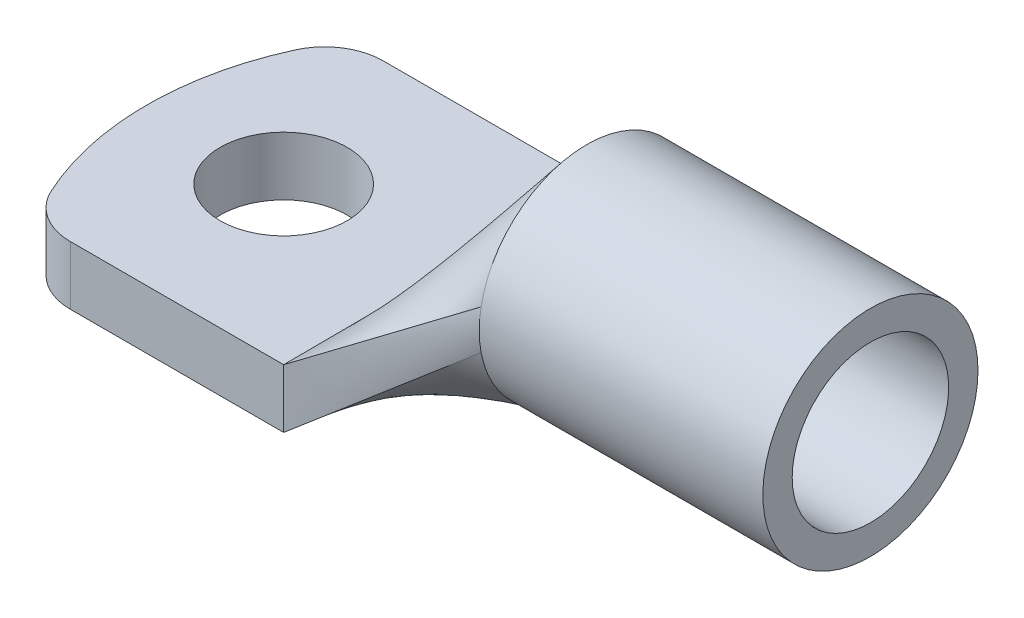
ISO-10303-21;
HEADER;
FILE_DESCRIPTION(('STEP AP214'),'2;1');
FILE_NAME('part.step','',(''),(''),'','','');
FILE_SCHEMA(('AUTOMOTIVE_DESIGN { 1 0 10303 214 1 1 1 1 }'));
ENDSEC;
DATA;
#1=APPLICATION_CONTEXT('core data for automotive mechanical design processes');
#2=APPLICATION_PROTOCOL_DEFINITION('international standard','automotive_design',2000,#1);
#3=PRODUCT_CONTEXT('',#1,'mechanical');
#4=PRODUCT('Part','Part','',(#3));
#5=PRODUCT_RELATED_PRODUCT_CATEGORY('part','',(#4));
#6=PRODUCT_DEFINITION_FORMATION('','',#4);
#7=PRODUCT_DEFINITION_CONTEXT('part definition',#1,'design');
#8=PRODUCT_DEFINITION('design','',#6,#7);
#9=PRODUCT_DEFINITION_SHAPE('','',#8);
#10=(LENGTH_UNIT() NAMED_UNIT(*) SI_UNIT(.MILLI.,.METRE.));
#11=(NAMED_UNIT(*) PLANE_ANGLE_UNIT() SI_UNIT($,.RADIAN.));
#12=(NAMED_UNIT(*) SI_UNIT($,.STERADIAN.) SOLID_ANGLE_UNIT());
#13=UNCERTAINTY_MEASURE_WITH_UNIT(LENGTH_MEASURE(1.E-05),#10,'distance_accuracy_value','');
#14=(GEOMETRIC_REPRESENTATION_CONTEXT(3) GLOBAL_UNCERTAINTY_ASSIGNED_CONTEXT((#13)) GLOBAL_UNIT_ASSIGNED_CONTEXT((#10,
#11,#12)) REPRESENTATION_CONTEXT('',''));
#15=CARTESIAN_POINT('',(0.,0.,0.));
#16=DIRECTION('',(0.,0.,1.));
#17=DIRECTION('',(1.,0.,0.));
#18=AXIS2_PLACEMENT_3D('',#15,#16,#17);
#19=CARTESIAN_POINT('',(0.,3.,-8.));
#20=DIRECTION('',(0.,0.,-1.));
#21=DIRECTION('',(-1.,0.,0.));
#22=AXIS2_PLACEMENT_3D('',#19,#20,#21);
#23=PLANE('',#22);
#24=DIRECTION('',(1.,0.,0.));
#25=VECTOR('',#24,1.);
#26=CARTESIAN_POINT('',(0.,0.,-8.));
#27=LINE('',#26,#25);
#28=CARTESIAN_POINT('',(-3.40871211463572,0.,-8.));
#29=VERTEX_POINT('',#28);
#30=CARTESIAN_POINT('',(7.5,0.,-8.));
#31=VERTEX_POINT('',#30);
#32=EDGE_CURVE('E170',#29,#31,#27,.T.);
#33=ORIENTED_EDGE('',*,*,#32,.F.);
#34=DIRECTION('',(0.,1.,0.));
#35=VECTOR('',#34,1.);
#36=CARTESIAN_POINT('',(-3.40871211463572,3.,-8.));
#37=LINE('',#36,#35);
#38=CARTESIAN_POINT('',(-3.40871211463572,3.,-8.));
#39=VERTEX_POINT('',#38);
#40=EDGE_CURVE('E332',#29,#39,#37,.T.);
#41=ORIENTED_EDGE('',*,*,#40,.T.);
#42=DIRECTION('',(1.,0.,0.));
#43=VECTOR('',#42,1.);
#44=CARTESIAN_POINT('',(0.,3.,-8.));
#45=LINE('',#44,#43);
#46=CARTESIAN_POINT('',(7.5,3.,-8.));
#47=VERTEX_POINT('',#46);
#48=EDGE_CURVE('E177',#39,#47,#45,.T.);
#49=ORIENTED_EDGE('',*,*,#48,.T.);
#50=DIRECTION('',(0.,1.,0.));
#51=VECTOR('',#50,1.);
#52=CARTESIAN_POINT('',(7.5,3.,-8.));
#53=LINE('',#52,#51);
#54=EDGE_CURVE('E183',#47,#31,#53,.F.);
#55=ORIENTED_EDGE('',*,*,#54,.T.);
#56=EDGE_LOOP('',(#33,#41,#49,#55));
#57=FACE_BOUND('',#56,.T.);
#58=ADVANCED_FACE('F72',(#57),#23,.T.);
#59=CARTESIAN_POINT('',(7.5,3.,0.));
#60=DIRECTION('',(0.,-1.,0.));
#61=DIRECTION('',(0.,0.,-1.));
#62=AXIS2_PLACEMENT_3D('',#59,#60,#61);
#63=CYLINDRICAL_SURFACE('',#62,15.);
#64=CARTESIAN_POINT('',(7.5,3.,0.));
#65=DIRECTION('',(0.,1.,0.));
#66=DIRECTION('',(0.,0.,1.));
#67=AXIS2_PLACEMENT_3D('',#64,#65,#66);
#68=CIRCLE('',#67,15.);
#69=CARTESIAN_POINT('',(-6.13589014329465,3.,-6.25));
#70=VERTEX_POINT('',#69);
#71=CARTESIAN_POINT('',(-6.13589014329465,3.,6.25));
#72=VERTEX_POINT('',#71);
#73=EDGE_CURVE('E176',#70,#72,#68,.T.);
#74=ORIENTED_EDGE('',*,*,#73,.F.);
#75=DIRECTION('',(0.,-1.,0.));
#76=VECTOR('',#75,1.);
#77=CARTESIAN_POINT('',(-6.13589014329465,3.,-6.25));
#78=LINE('',#77,#76);
#79=CARTESIAN_POINT('',(-6.13589014329465,0.,-6.25));
#80=VERTEX_POINT('',#79);
#81=EDGE_CURVE('E155',#70,#80,#78,.T.);
#82=ORIENTED_EDGE('',*,*,#81,.T.);
#83=CARTESIAN_POINT('',(7.5,0.,0.));
#84=DIRECTION('',(0.,1.,0.));
#85=DIRECTION('',(0.,0.,1.));
#86=AXIS2_PLACEMENT_3D('',#83,#84,#85);
#87=CIRCLE('',#86,15.);
#88=CARTESIAN_POINT('',(-6.13589014329465,0.,6.25));
#89=VERTEX_POINT('',#88);
#90=EDGE_CURVE('E166',#80,#89,#87,.T.);
#91=ORIENTED_EDGE('',*,*,#90,.T.);
#92=DIRECTION('',(0.,-1.,0.));
#93=VECTOR('',#92,1.);
#94=CARTESIAN_POINT('',(-6.13589014329465,3.,6.25));
#95=LINE('',#94,#93);
#96=EDGE_CURVE('E151',#89,#72,#95,.F.);
#97=ORIENTED_EDGE('',*,*,#96,.T.);
#98=EDGE_LOOP('',(#74,#82,#91,#97));
#99=FACE_BOUND('',#98,.T.);
#100=ADVANCED_FACE('F341',(#99),#63,.T.);
#101=CARTESIAN_POINT('',(0.,3.,8.));
#102=DIRECTION('',(0.,0.,-1.));
#103=DIRECTION('',(-1.,0.,0.));
#104=AXIS2_PLACEMENT_3D('',#101,#102,#103);
#105=PLANE('',#104);
#106=DIRECTION('',(1.,0.,0.));
#107=VECTOR('',#106,1.);
#108=CARTESIAN_POINT('',(0.,3.,8.));
#109=LINE('',#108,#107);
#110=CARTESIAN_POINT('',(-3.40871211463572,3.,8.));
#111=VERTEX_POINT('',#110);
#112=CARTESIAN_POINT('',(7.49999999999999,3.,8.));
#113=VERTEX_POINT('',#112);
#114=EDGE_CURVE('E162',#111,#113,#109,.T.);
#115=ORIENTED_EDGE('',*,*,#114,.F.);
#116=DIRECTION('',(0.,-1.,0.));
#117=VECTOR('',#116,1.);
#118=CARTESIAN_POINT('',(-3.40871211463572,3.,8.));
#119=LINE('',#118,#117);
#120=CARTESIAN_POINT('',(-3.40871211463572,0.,8.));
#121=VERTEX_POINT('',#120);
#122=EDGE_CURVE('E83',#111,#121,#119,.T.);
#123=ORIENTED_EDGE('',*,*,#122,.T.);
#124=DIRECTION('',(1.,0.,0.));
#125=VECTOR('',#124,1.);
#126=CARTESIAN_POINT('',(0.,0.,8.));
#127=LINE('',#126,#125);
#128=CARTESIAN_POINT('',(7.5,0.,8.));
#129=VERTEX_POINT('',#128);
#130=EDGE_CURVE('E160',#121,#129,#127,.T.);
#131=ORIENTED_EDGE('',*,*,#130,.T.);
#132=DIRECTION('',(0.,1.,0.));
#133=VECTOR('',#132,1.);
#134=CARTESIAN_POINT('',(7.5,3.,8.));
#135=LINE('',#134,#133);
#136=EDGE_CURVE('E181',#113,#129,#135,.F.);
#137=ORIENTED_EDGE('',*,*,#136,.F.);
#138=EDGE_LOOP('',(#115,#123,#131,#137));
#139=FACE_BOUND('',#138,.T.);
#140=ADVANCED_FACE('F158',(#139),#105,.F.);
#141=CARTESIAN_POINT('',(-0.500000000000001,3.,0.));
#142=DIRECTION('',(0.,-1.,0.));
#143=DIRECTION('',(0.,0.,-1.));
#144=AXIS2_PLACEMENT_3D('',#141,#142,#143);
#145=CYLINDRICAL_SURFACE('',#144,3.25);
#146=CARTESIAN_POINT('',(-0.500000000000001,3.,0.));
#147=DIRECTION('',(0.,1.,0.));
#148=DIRECTION('',(0.,0.,1.));
#149=AXIS2_PLACEMENT_3D('',#146,#147,#148);
#150=CIRCLE('',#149,3.25);
#151=CARTESIAN_POINT('',(-0.500000000000001,3.,3.25));
#152=VERTEX_POINT('',#151);
#153=EDGE_CURVE('E168',#152,#152,#150,.T.);
#154=ORIENTED_EDGE('',*,*,#153,.T.);
#155=EDGE_LOOP('',(#154));
#156=FACE_BOUND('',#155,.T.);
#157=CARTESIAN_POINT('',(-0.500000000000001,0.,0.));
#158=DIRECTION('',(0.,1.,0.));
#159=DIRECTION('',(0.,0.,1.));
#160=AXIS2_PLACEMENT_3D('',#157,#158,#159);
#161=CIRCLE('',#160,3.25);
#162=CARTESIAN_POINT('',(-0.500000000000001,0.,3.25));
#163=VERTEX_POINT('',#162);
#164=EDGE_CURVE('E180',#163,#163,#161,.T.);
#165=ORIENTED_EDGE('',*,*,#164,.F.);
#166=EDGE_LOOP('',(#165));
#167=FACE_BOUND('',#166,.T.);
#168=ADVANCED_FACE('F360',(#156,#167),#145,.F.);
#169=CARTESIAN_POINT('',(0.,3.,0.));
#170=DIRECTION('',(0.,1.,0.));
#171=DIRECTION('',(0.,0.,1.));
#172=AXIS2_PLACEMENT_3D('',#169,#170,#171);
#173=PLANE('',#172);
#174=ORIENTED_EDGE('',*,*,#153,.F.);
#175=EDGE_LOOP('',(#174));
#176=FACE_BOUND('',#175,.T.);
#177=ORIENTED_EDGE('',*,*,#48,.F.);
#178=CARTESIAN_POINT('',(-3.40871211463572,3.,-5.));
#179=DIRECTION('',(0.,1.,0.));
#180=DIRECTION('',(0.,0.,1.));
#181=AXIS2_PLACEMENT_3D('',#178,#179,#180);
#182=CIRCLE('',#181,3.);
#183=EDGE_CURVE('E163',#39,#70,#182,.T.);
#184=ORIENTED_EDGE('',*,*,#183,.T.);
#185=ORIENTED_EDGE('',*,*,#73,.T.);
#186=CARTESIAN_POINT('',(-3.40871211463572,3.,5.));
#187=DIRECTION('',(0.,1.,0.));
#188=DIRECTION('',(0.,0.,1.));
#189=AXIS2_PLACEMENT_3D('',#186,#187,#188);
#190=CIRCLE('',#189,3.);
#191=EDGE_CURVE('E92',#72,#111,#190,.T.);
#192=ORIENTED_EDGE('',*,*,#191,.T.);
#193=ORIENTED_EDGE('',*,*,#114,.T.);
#194=DIRECTION('',(0.,0.,1.));
#195=VECTOR('',#194,1.);
#196=CARTESIAN_POINT('',(7.5,3.,0.));
#197=LINE('',#196,#195);
#198=EDGE_CURVE('E175',#113,#47,#197,.F.);
#199=ORIENTED_EDGE('',*,*,#198,.T.);
#200=EDGE_LOOP('',(#177,#184,#185,#192,#193,#199));
#201=FACE_BOUND('',#200,.T.);
#202=ADVANCED_FACE('F327',(#176,#201),#173,.T.);
#203=CARTESIAN_POINT('',(0.,0.,0.));
#204=DIRECTION('',(0.,1.,0.));
#205=DIRECTION('',(0.,0.,1.));
#206=AXIS2_PLACEMENT_3D('',#203,#204,#205);
#207=PLANE('',#206);
#208=ORIENTED_EDGE('',*,*,#164,.T.);
#209=EDGE_LOOP('',(#208));
#210=FACE_BOUND('',#209,.T.);
#211=ORIENTED_EDGE('',*,*,#90,.F.);
#212=CARTESIAN_POINT('',(-3.40871211463572,0.,-5.));
#213=DIRECTION('',(0.,1.,0.));
#214=DIRECTION('',(0.,0.,1.));
#215=AXIS2_PLACEMENT_3D('',#212,#213,#214);
#216=CIRCLE('',#215,3.);
#217=EDGE_CURVE('E154',#80,#29,#216,.F.);
#218=ORIENTED_EDGE('',*,*,#217,.T.);
#219=ORIENTED_EDGE('',*,*,#32,.T.);
#220=DIRECTION('',(0.,0.,1.));
#221=VECTOR('',#220,1.);
#222=CARTESIAN_POINT('',(7.5,0.,0.));
#223=LINE('',#222,#221);
#224=EDGE_CURVE('E112',#129,#31,#223,.F.);
#225=ORIENTED_EDGE('',*,*,#224,.F.);
#226=ORIENTED_EDGE('',*,*,#130,.F.);
#227=CARTESIAN_POINT('',(-3.40871211463572,0.,5.));
#228=DIRECTION('',(0.,1.,0.));
#229=DIRECTION('',(0.,0.,1.));
#230=AXIS2_PLACEMENT_3D('',#227,#228,#229);
#231=CIRCLE('',#230,3.);
#232=EDGE_CURVE('E149',#121,#89,#231,.F.);
#233=ORIENTED_EDGE('',*,*,#232,.T.);
#234=EDGE_LOOP('',(#211,#218,#219,#225,#226,#233));
#235=FACE_BOUND('',#234,.T.);
#236=ADVANCED_FACE('F165',(#210,#235),#207,.F.);
#237=CARTESIAN_POINT('',(-3.40871211463572,3.,-5.));
#238=DIRECTION('',(0.,-1.,0.));
#239=DIRECTION('',(0.,0.,-1.));
#240=AXIS2_PLACEMENT_3D('',#237,#238,#239);
#241=CYLINDRICAL_SURFACE('',#240,3.);
#242=ORIENTED_EDGE('',*,*,#183,.F.);
#243=ORIENTED_EDGE('',*,*,#40,.F.);
#244=ORIENTED_EDGE('',*,*,#217,.F.);
#245=ORIENTED_EDGE('',*,*,#81,.F.);
#246=EDGE_LOOP('',(#242,#243,#244,#245));
#247=FACE_BOUND('',#246,.T.);
#248=ADVANCED_FACE('F342',(#247),#241,.T.);
#249=CARTESIAN_POINT('',(-3.40871211463572,3.,5.));
#250=DIRECTION('',(0.,-1.,0.));
#251=DIRECTION('',(0.,0.,-1.));
#252=AXIS2_PLACEMENT_3D('',#249,#250,#251);
#253=CYLINDRICAL_SURFACE('',#252,3.);
#254=ORIENTED_EDGE('',*,*,#191,.F.);
#255=ORIENTED_EDGE('',*,*,#96,.F.);
#256=ORIENTED_EDGE('',*,*,#232,.F.);
#257=ORIENTED_EDGE('',*,*,#122,.F.);
#258=EDGE_LOOP('',(#254,#255,#256,#257));
#259=FACE_BOUND('',#258,.T.);
#260=ADVANCED_FACE('F74',(#259),#253,.T.);
#261=CARTESIAN_POINT('',(7.5,0.,-8.));
#262=CARTESIAN_POINT('',(15.,5.98641305722398,-5.40579702813877));
#263=CARTESIAN_POINT('',(7.5,0.499999999999998,-8.));
#264=CARTESIAN_POINT('',(15.,6.31848852892209,-5.46806117908217));
#265=CARTESIAN_POINT('',(7.5,0.999999999999997,-8.));
#266=CARTESIAN_POINT('',(15.,6.65924426446105,-5.49919325455386));
#267=CARTESIAN_POINT('',(7.5,2.,-8.));
#268=CARTESIAN_POINT('',(15.,7.34075573553895,-5.49919325455386));
#269=CARTESIAN_POINT('',(7.5,2.5,-8.));
#270=CARTESIAN_POINT('',(15.,7.68151147107791,-5.46806117908217));
#271=CARTESIAN_POINT('',(7.5,3.,-8.));
#272=CARTESIAN_POINT('',(15.,8.01358694277602,-5.40579702813877));
#273=B_SPLINE_SURFACE_WITH_KNOTS('',3,1,((#261,#262),(#263,#264),(#265,#266),(#267,#268),(#269,
#270),(#271,#272)),.UNSPECIFIED.,.F.,.F.,.F.,(4,2,4),(2,2),(0.,0.5,1.),(0.,1.),.UNSPECIFIED.);
#274=DIRECTION('',(0.798976519768319,0.534098432946009,0.276360968270708));
#275=VECTOR('',#274,1.);
#276=CARTESIAN_POINT('',(11.25,5.50679347138801,-6.70289851406938));
#277=LINE('',#276,#275);
#278=CARTESIAN_POINT('',(15.,8.01368475137346,-5.40632015341546));
#279=VERTEX_POINT('',#278);
#280=EDGE_CURVE('E314',#47,#279,#277,.T.);
#281=CARTESIAN_POINT('',(15.,7.,0.));
#282=DIRECTION('',(1.,0.,0.));
#283=DIRECTION('',(0.,0.,-1.));
#284=AXIS2_PLACEMENT_3D('',#281,#282,#283);
#285=CIRCLE('',#284,5.5);
#286=CARTESIAN_POINT('',(15.,5.98632174534013,-5.40628498273034));
#287=VERTEX_POINT('',#286);
#288=EDGE_CURVE('E76',#287,#279,#285,.T.);
#289=DIRECTION('',(-0.754475886852295,-0.602213906721763,-0.260968478382648));
#290=VECTOR('',#289,1.);
#291=CARTESIAN_POINT('',(11.25,2.99320652861199,-6.70289851406938));
#292=LINE('',#291,#290);
#293=EDGE_CURVE('E311',#287,#31,#292,.T.);
#294=ORIENTED_EDGE('',*,*,#54,.F.);
#295=ORIENTED_EDGE('',*,*,#280,.T.);
#296=ORIENTED_EDGE('',*,*,#288,.F.);
#297=ORIENTED_EDGE('',*,*,#293,.T.);
#298=EDGE_LOOP('',(#294,#295,#296,#297));
#299=FACE_BOUND('',#298,.T.);
#300=ADVANCED_FACE('F240',(#299),#273,.T.);
#301=CARTESIAN_POINT('',(7.5,3.,-8.));
#302=CARTESIAN_POINT('',(15.,8.01358694277602,-5.40579702813877));
#303=CARTESIAN_POINT('',(7.5,3.,-7.33333333333333));
#304=CARTESIAN_POINT('',(15.,8.45635423837351,-5.32277816021424));
#305=CARTESIAN_POINT('',(7.5,3.,-6.66666666666666));
#306=CARTESIAN_POINT('',(15.,8.9362970174126,-5.1770081596021));
#307=CARTESIAN_POINT('',(7.5,3.,-5.33333333333333));
#308=CARTESIAN_POINT('',(15.,9.92027396943033,-4.69283065619198));
#309=CARTESIAN_POINT('',(7.5,3.,-4.66666666666666));
#310=CARTESIAN_POINT('',(15.,10.4246028975972,-4.35239116219027));
#311=CARTESIAN_POINT('',(7.5,3.,-3.33333333333333));
#312=CARTESIAN_POINT('',(15.,11.3436149011101,-3.43572749585847));
#313=CARTESIAN_POINT('',(7.5,3.,-2.66666666666666));
#314=CARTESIAN_POINT('',(15.,11.7558397927119,-2.85726527161543));
#315=CARTESIAN_POINT('',(7.5,3.,-1.66666666666666));
#316=CARTESIAN_POINT('',(15.,12.1910936742479,-1.85352116436908));
#317=CARTESIAN_POINT('',(7.5,3.,-1.33333333333333));
#318=CARTESIAN_POINT('',(15.,12.3056261169663,-1.49731687768935));
#319=CARTESIAN_POINT('',(7.5,3.,-0.666666666666663));
#320=CARTESIAN_POINT('',(15.,12.4601275626916,-0.760679514897159));
#321=CARTESIAN_POINT('',(7.5,3.,-0.33333333333333));
#322=CARTESIAN_POINT('',(15.,12.5,-0.380382881659106));
#323=CARTESIAN_POINT('',(7.5,3.,0.333333333333337));
#324=CARTESIAN_POINT('',(15.,12.5,0.380382881659107));
#325=CARTESIAN_POINT('',(7.5,3.,0.66666666666667));
#326=CARTESIAN_POINT('',(15.,12.4601275626916,0.76067951489716));
#327=CARTESIAN_POINT('',(7.5,3.,1.33333333333334));
#328=CARTESIAN_POINT('',(15.,12.3056261169663,1.49731687768935));
#329=CARTESIAN_POINT('',(7.5,3.,1.66666666666667));
#330=CARTESIAN_POINT('',(15.,12.1910936742479,1.85352116436908));
#331=CARTESIAN_POINT('',(7.5,3.,2.66666666666667));
#332=CARTESIAN_POINT('',(15.,11.7558397927119,2.85726527161543));
#333=CARTESIAN_POINT('',(7.5,3.,3.33333333333334));
#334=CARTESIAN_POINT('',(15.,11.3436149011101,3.43572749585847));
#335=CARTESIAN_POINT('',(7.5,3.,4.66666666666667));
#336=CARTESIAN_POINT('',(15.,10.4246028975972,4.35239116219027));
#337=CARTESIAN_POINT('',(7.5,3.,5.33333333333334));
#338=CARTESIAN_POINT('',(15.,9.92027396943034,4.69283065619198));
#339=CARTESIAN_POINT('',(7.5,3.,6.66666666666667));
#340=CARTESIAN_POINT('',(15.,8.9362970174126,5.1770081596021));
#341=CARTESIAN_POINT('',(7.5,3.,7.33333333333334));
#342=CARTESIAN_POINT('',(15.,8.45635423837351,5.32277816021424));
#343=CARTESIAN_POINT('',(7.5,3.,8.));
#344=CARTESIAN_POINT('',(15.,8.01358694277602,5.40579702813877));
#345=B_SPLINE_SURFACE_WITH_KNOTS('',3,1,((#301,#302),(#303,#304),(#305,#306),(#307,#308),(#309,
#310),(#311,#312),(#313,#314),(#315,#316),(#317,#318),(#319,#320),(#321,#322),(#323,#324),(#325,
#326),(#327,#328),(#329,#330),(#331,#332),(#333,#334),(#335,#336),(#337,#338),(#339,#340),(#341,
#342),(#343,#344)),.UNSPECIFIED.,.F.,.F.,.F.,(4,2,2,2,2,2,2,2,2,2,4),(2,2),(0.,0.125,0.25,0.375,
0.4375,0.5,0.5625,0.625,0.75,0.875,1.),(0.,1.),.UNSPECIFIED.);
#346=DIRECTION('',(0.798976519768319,0.534098432946009,-0.276360968270709));
#347=VECTOR('',#346,1.);
#348=CARTESIAN_POINT('',(11.25,5.50679347138801,6.70289851406939));
#349=LINE('',#348,#347);
#350=CARTESIAN_POINT('',(15.,8.01368196419589,5.4063046315737));
#351=VERTEX_POINT('',#350);
#352=EDGE_CURVE('E318',#113,#351,#349,.T.);
#353=EDGE_CURVE('E191',#279,#351,#285,.T.);
#354=ORIENTED_EDGE('',*,*,#198,.F.);
#355=ORIENTED_EDGE('',*,*,#352,.T.);
#356=ORIENTED_EDGE('',*,*,#353,.F.);
#357=ORIENTED_EDGE('',*,*,#280,.F.);
#358=EDGE_LOOP('',(#354,#355,#356,#357));
#359=FACE_BOUND('',#358,.T.);
#360=ADVANCED_FACE('F245',(#359),#345,.T.);
#361=CARTESIAN_POINT('',(7.5,0.,8.));
#362=CARTESIAN_POINT('',(15.,5.98641305722398,5.40579702813877));
#363=CARTESIAN_POINT('',(7.5,0.,7.33333333333333));
#364=CARTESIAN_POINT('',(15.,5.5436457616265,5.32277816021424));
#365=CARTESIAN_POINT('',(7.5,0.,6.66666666666666));
#366=CARTESIAN_POINT('',(15.,5.0637029825874,5.1770081596021));
#367=CARTESIAN_POINT('',(7.5,0.,5.33333333333333));
#368=CARTESIAN_POINT('',(15.,4.07972603056967,4.69283065619198));
#369=CARTESIAN_POINT('',(7.5,0.,4.66666666666666));
#370=CARTESIAN_POINT('',(15.,3.57539710240276,4.35239116219027));
#371=CARTESIAN_POINT('',(7.5,0.,3.33333333333332));
#372=CARTESIAN_POINT('',(15.,2.65638509888993,3.43572749585847));
#373=CARTESIAN_POINT('',(7.5,0.,2.66666666666665));
#374=CARTESIAN_POINT('',(15.,2.24416020728808,2.85726527161543));
#375=CARTESIAN_POINT('',(7.5,0.,1.66666666666665));
#376=CARTESIAN_POINT('',(15.,1.80890632575213,1.85352116436908));
#377=CARTESIAN_POINT('',(7.5,0.,1.33333333333332));
#378=CARTESIAN_POINT('',(15.,1.69437388303371,1.49731687768935));
#379=CARTESIAN_POINT('',(7.5,0.,0.666666666666654));
#380=CARTESIAN_POINT('',(15.,1.53987243730845,0.76067951489716));
#381=CARTESIAN_POINT('',(7.5,0.,0.333333333333321));
#382=CARTESIAN_POINT('',(15.,1.5,0.380382881659108));
#383=CARTESIAN_POINT('',(7.5,0.,-0.333333333333346));
#384=CARTESIAN_POINT('',(15.,1.5,-0.380382881659105));
#385=CARTESIAN_POINT('',(7.5,0.,-0.66666666666668));
#386=CARTESIAN_POINT('',(15.,1.53987243730845,-0.760679514897158));
#387=CARTESIAN_POINT('',(7.5,0.,-1.33333333333335));
#388=CARTESIAN_POINT('',(15.,1.69437388303371,-1.49731687768935));
#389=CARTESIAN_POINT('',(7.5,0.,-1.66666666666668));
#390=CARTESIAN_POINT('',(15.,1.80890632575212,-1.85352116436908));
#391=CARTESIAN_POINT('',(7.5,0.,-2.66666666666668));
#392=CARTESIAN_POINT('',(15.,2.24416020728808,-2.85726527161543));
#393=CARTESIAN_POINT('',(7.5,0.,-3.33333333333334));
#394=CARTESIAN_POINT('',(15.,2.65638509888993,-3.43572749585847));
#395=CARTESIAN_POINT('',(7.5,0.,-4.66666666666667));
#396=CARTESIAN_POINT('',(15.,3.57539710240276,-4.35239116219027));
#397=CARTESIAN_POINT('',(7.5,0.,-5.33333333333334));
#398=CARTESIAN_POINT('',(15.,4.07972603056967,-4.69283065619198));
#399=CARTESIAN_POINT('',(7.5,0.,-6.66666666666667));
#400=CARTESIAN_POINT('',(15.,5.0637029825874,-5.1770081596021));
#401=CARTESIAN_POINT('',(7.5,0.,-7.33333333333333));
#402=CARTESIAN_POINT('',(15.,5.5436457616265,-5.32277816021424));
#403=CARTESIAN_POINT('',(7.5,0.,-8.));
#404=CARTESIAN_POINT('',(15.,5.98641305722398,-5.40579702813877));
#405=B_SPLINE_SURFACE_WITH_KNOTS('',3,1,((#361,#362),(#363,#364),(#365,#366),(#367,#368),(#369,
#370),(#371,#372),(#373,#374),(#375,#376),(#377,#378),(#379,#380),(#381,#382),(#383,#384),(#385,
#386),(#387,#388),(#389,#390),(#391,#392),(#393,#394),(#395,#396),(#397,#398),(#399,#400),(#401,
#402),(#403,#404)),.UNSPECIFIED.,.F.,.F.,.F.,(4,2,2,2,2,2,2,2,2,2,4),(2,2),(0.,0.125,0.25,0.375,
0.4375,0.5,0.5625,0.625,0.75,0.875,1.),(0.,1.),.UNSPECIFIED.);
#406=CARTESIAN_POINT('',(15.,5.98631896387682,5.40630045538244));
#407=VERTEX_POINT('',#406);
#408=EDGE_CURVE('E123',#407,#287,#285,.T.);
#409=DIRECTION('',(0.754475886852295,0.602213906721763,-0.260968478382648));
#410=VECTOR('',#409,1.);
#411=CARTESIAN_POINT('',(11.25,2.99320652861199,6.70289851406939));
#412=LINE('',#411,#410);
#413=EDGE_CURVE('E192',#129,#407,#412,.T.);
#414=ORIENTED_EDGE('',*,*,#224,.T.);
#415=ORIENTED_EDGE('',*,*,#293,.F.);
#416=ORIENTED_EDGE('',*,*,#408,.F.);
#417=ORIENTED_EDGE('',*,*,#413,.F.);
#418=EDGE_LOOP('',(#414,#415,#416,#417));
#419=FACE_BOUND('',#418,.T.);
#420=ADVANCED_FACE('F269',(#419),#405,.T.);
#421=CARTESIAN_POINT('',(7.5,3.,8.));
#422=CARTESIAN_POINT('',(15.,8.01358694277602,5.40579702813877));
#423=CARTESIAN_POINT('',(7.5,2.5,8.));
#424=CARTESIAN_POINT('',(15.,7.68151147107791,5.46806117908217));
#425=CARTESIAN_POINT('',(7.5,2.,8.));
#426=CARTESIAN_POINT('',(15.,7.34075573553895,5.49919325455386));
#427=CARTESIAN_POINT('',(7.5,1.,8.));
#428=CARTESIAN_POINT('',(15.,6.65924426446105,5.49919325455386));
#429=CARTESIAN_POINT('',(7.5,0.5,8.));
#430=CARTESIAN_POINT('',(15.,6.31848852892209,5.46806117908217));
#431=CARTESIAN_POINT('',(7.5,0.,8.));
#432=CARTESIAN_POINT('',(15.,5.98641305722398,5.40579702813877));
#433=B_SPLINE_SURFACE_WITH_KNOTS('',3,1,((#421,#422),(#423,#424),(#425,#426),(#427,#428),(#429,
#430),(#431,#432)),.UNSPECIFIED.,.F.,.F.,.F.,(4,2,4),(2,2),(0.,0.5,1.),(0.,1.),.UNSPECIFIED.);
#434=EDGE_CURVE('E188',#351,#407,#285,.T.);
#435=ORIENTED_EDGE('',*,*,#136,.T.);
#436=ORIENTED_EDGE('',*,*,#413,.T.);
#437=ORIENTED_EDGE('',*,*,#434,.F.);
#438=ORIENTED_EDGE('',*,*,#352,.F.);
#439=EDGE_LOOP('',(#435,#436,#437,#438));
#440=FACE_BOUND('',#439,.T.);
#441=ADVANCED_FACE('F280',(#440),#433,.T.);
#442=CARTESIAN_POINT('',(29.5,7.,0.));
#443=DIRECTION('',(1.,0.,0.));
#444=DIRECTION('',(0.,0.,-1.));
#445=AXIS2_PLACEMENT_3D('',#442,#443,#444);
#446=PLANE('',#445);
#447=CARTESIAN_POINT('',(29.5,7.,0.));
#448=DIRECTION('',(1.,0.,0.));
#449=DIRECTION('',(0.,0.,-1.));
#450=AXIS2_PLACEMENT_3D('',#447,#448,#449);
#451=CIRCLE('',#450,5.5);
#452=CARTESIAN_POINT('',(29.5,7.,-5.5));
#453=VERTEX_POINT('',#452);
#454=EDGE_CURVE('E220',#453,#453,#451,.T.);
#455=ORIENTED_EDGE('',*,*,#454,.T.);
#456=EDGE_LOOP('',(#455));
#457=FACE_BOUND('',#456,.T.);
#458=CARTESIAN_POINT('',(29.5,7.,0.));
#459=DIRECTION('',(1.,0.,0.));
#460=DIRECTION('',(0.,0.,-1.));
#461=AXIS2_PLACEMENT_3D('',#458,#459,#460);
#462=CIRCLE('',#461,4.);
#463=CARTESIAN_POINT('',(29.5,7.,4.));
#464=VERTEX_POINT('',#463);
#465=EDGE_CURVE('E463',#464,#464,#462,.T.);
#466=ORIENTED_EDGE('',*,*,#465,.F.);
#467=EDGE_LOOP('',(#466));
#468=FACE_BOUND('',#467,.T.);
#469=ADVANCED_FACE('F237',(#457,#468),#446,.T.);
#470=CARTESIAN_POINT('',(29.5,7.,0.));
#471=DIRECTION('',(-1.,0.,0.));
#472=DIRECTION('',(0.,0.,1.));
#473=AXIS2_PLACEMENT_3D('',#470,#471,#472);
#474=CYLINDRICAL_SURFACE('',#473,5.5);
#475=ORIENTED_EDGE('',*,*,#454,.F.);
#476=EDGE_LOOP('',(#475));
#477=FACE_BOUND('',#476,.T.);
#478=ORIENTED_EDGE('',*,*,#353,.T.);
#479=ORIENTED_EDGE('',*,*,#434,.T.);
#480=ORIENTED_EDGE('',*,*,#408,.T.);
#481=ORIENTED_EDGE('',*,*,#288,.T.);
#482=EDGE_LOOP('',(#478,#479,#480,#481));
#483=FACE_BOUND('',#482,.T.);
#484=ADVANCED_FACE('F212',(#477,#483),#474,.T.);
#485=CARTESIAN_POINT('',(29.5,7.,0.));
#486=DIRECTION('',(-1.,0.,0.));
#487=DIRECTION('',(0.,0.,1.));
#488=AXIS2_PLACEMENT_3D('',#485,#486,#487);
#489=CYLINDRICAL_SURFACE('',#488,4.);
#490=CARTESIAN_POINT('',(15.,7.,0.));
#491=DIRECTION('',(1.,0.,0.));
#492=DIRECTION('',(0.,0.,-1.));
#493=AXIS2_PLACEMENT_3D('',#490,#491,#492);
#494=CIRCLE('',#493,4.);
#495=CARTESIAN_POINT('',(15.,7.,4.));
#496=VERTEX_POINT('',#495);
#497=EDGE_CURVE('E12',#496,#496,#494,.F.);
#498=CARTESIAN_POINT('',(29.5,7.,4.));
#499=CARTESIAN_POINT('',(29.3489583333333,7.,4.));
#500=CARTESIAN_POINT('',(29.1979166666667,7.,4.));
#501=CARTESIAN_POINT('',(28.8958333333333,7.,4.));
#502=CARTESIAN_POINT('',(28.7447916666667,7.,4.));
#503=CARTESIAN_POINT('',(28.4427083333333,7.,4.));
#504=CARTESIAN_POINT('',(28.2916666666667,7.,4.));
#505=CARTESIAN_POINT('',(27.9895833333333,7.,4.));
#506=CARTESIAN_POINT('',(27.8385416666667,7.,4.));
#507=CARTESIAN_POINT('',(27.5364583333333,7.,4.));
#508=CARTESIAN_POINT('',(27.3854166666667,7.,4.));
#509=CARTESIAN_POINT('',(27.0833333333333,7.,4.));
#510=CARTESIAN_POINT('',(26.9322916666667,7.,4.));
#511=CARTESIAN_POINT('',(26.6302083333333,7.,4.));
#512=CARTESIAN_POINT('',(26.4791666666667,7.,4.));
#513=CARTESIAN_POINT('',(26.1770833333333,7.,4.));
#514=CARTESIAN_POINT('',(26.0260416666667,7.,4.));
#515=CARTESIAN_POINT('',(25.7239583333333,7.,4.));
#516=CARTESIAN_POINT('',(25.5729166666667,7.,4.));
#517=CARTESIAN_POINT('',(25.2708333333333,7.,4.));
#518=CARTESIAN_POINT('',(25.1197916666667,7.,4.));
#519=CARTESIAN_POINT('',(24.8177083333333,7.,4.));
#520=CARTESIAN_POINT('',(24.6666666666667,7.,4.));
#521=CARTESIAN_POINT('',(24.3645833333333,7.,4.));
#522=CARTESIAN_POINT('',(24.2135416666667,7.,4.));
#523=CARTESIAN_POINT('',(23.9114583333333,7.,4.));
#524=CARTESIAN_POINT('',(23.7604166666667,7.,4.));
#525=CARTESIAN_POINT('',(23.4583333333333,7.,4.));
#526=CARTESIAN_POINT('',(23.3072916666667,7.,4.));
#527=CARTESIAN_POINT('',(23.0052083333333,7.,4.));
#528=CARTESIAN_POINT('',(22.8541666666667,7.,4.));
#529=CARTESIAN_POINT('',(22.5520833333333,7.,4.));
#530=CARTESIAN_POINT('',(22.4010416666667,7.,4.));
#531=CARTESIAN_POINT('',(22.0989583333333,7.,4.));
#532=CARTESIAN_POINT('',(21.9479166666667,7.,4.));
#533=CARTESIAN_POINT('',(21.6458333333333,7.,4.));
#534=CARTESIAN_POINT('',(21.4947916666667,7.,4.));
#535=CARTESIAN_POINT('',(21.1927083333333,7.,4.));
#536=CARTESIAN_POINT('',(21.0416666666667,7.,4.));
#537=CARTESIAN_POINT('',(20.7395833333333,7.,4.));
#538=CARTESIAN_POINT('',(20.5885416666667,7.,4.));
#539=CARTESIAN_POINT('',(20.2864583333333,7.,4.));
#540=CARTESIAN_POINT('',(20.1354166666667,7.,4.));
#541=CARTESIAN_POINT('',(19.8333333333333,7.,4.));
#542=CARTESIAN_POINT('',(19.6822916666667,7.,4.));
#543=CARTESIAN_POINT('',(19.3802083333333,7.,4.));
#544=CARTESIAN_POINT('',(19.2291666666667,7.,4.));
#545=CARTESIAN_POINT('',(18.9270833333333,7.,4.));
#546=CARTESIAN_POINT('',(18.7760416666667,7.,4.));
#547=CARTESIAN_POINT('',(18.4739583333333,7.,4.));
#548=CARTESIAN_POINT('',(18.3229166666667,7.,4.));
#549=CARTESIAN_POINT('',(18.0208333333333,7.,4.));
#550=CARTESIAN_POINT('',(17.8697916666667,7.,4.));
#551=CARTESIAN_POINT('',(17.5677083333333,7.,4.));
#552=CARTESIAN_POINT('',(17.4166666666667,7.,4.));
#553=CARTESIAN_POINT('',(17.1145833333333,7.,4.));
#554=CARTESIAN_POINT('',(16.9635416666667,7.,4.));
#555=CARTESIAN_POINT('',(16.6614583333333,7.,4.));
#556=CARTESIAN_POINT('',(16.5104166666667,7.,4.));
#557=CARTESIAN_POINT('',(16.2083333333333,7.,4.));
#558=CARTESIAN_POINT('',(16.0572916666667,7.,4.));
#559=CARTESIAN_POINT('',(15.7552083333333,7.,4.));
#560=CARTESIAN_POINT('',(15.6041666666667,7.,4.));
#561=CARTESIAN_POINT('',(15.3020833333333,7.,4.));
#562=CARTESIAN_POINT('',(15.1510416666667,7.,4.));
#563=CARTESIAN_POINT('',(15.,7.,4.));
#564=B_SPLINE_CURVE_WITH_KNOTS('',3,(#498,#499,#500,#501,#502,#503,#504,#505,#506,#507,#508,
#509,#510,#511,#512,#513,#514,#515,#516,#517,#518,#519,#520,#521,#522,#523,#524,#525,#526,#527,
#528,#529,#530,#531,#532,#533,#534,#535,#536,#537,#538,#539,#540,#541,#542,#543,#544,#545,#546,
#547,#548,#549,#550,#551,#552,#553,#554,#555,#556,#557,#558,#559,#560,#561,#562,#563),
.UNSPECIFIED.,.F.,.F.,(4,2,2,2,2,2,2,2,2,2,2,2,2,2,2,2,2,2,2,2,2,2,2,2,2,2,2,2,2,2,2,2,4),(0.,
0.453125000000002,0.906250000000001,1.359375,1.8125,2.265625,2.71875,3.171875,3.625,4.078125,
4.53125,4.984375,5.4375,5.890625,6.34375,6.796875,7.25,7.703125,8.15625,8.609375,9.0625,
9.515625,9.96875,10.421875,10.875,11.328125,11.78125,12.234375,12.6875,13.140625,13.59375,
14.046875,14.5),.UNSPECIFIED.);
#565=EDGE_CURVE('BSEAM236',#464,#496,#564,.T.);
#566=ORIENTED_EDGE('',*,*,#465,.T.);
#567=ORIENTED_EDGE('',*,*,#497,.T.);
#568=ORIENTED_EDGE('',*,*,#565,.T.);
#569=ORIENTED_EDGE('',*,*,#565,.F.);
#570=EDGE_LOOP('',(#566,#568,#567,#569));
#571=FACE_BOUND('',#570,.T.);
#572=ADVANCED_FACE('F236',(#571),#489,.F.);
#573=CARTESIAN_POINT('',(15.,7.,0.));
#574=DIRECTION('',(1.,0.,0.));
#575=DIRECTION('',(0.,0.,-1.));
#576=AXIS2_PLACEMENT_3D('',#573,#574,#575);
#577=PLANE('',#576);
#578=ORIENTED_EDGE('',*,*,#497,.F.);
#579=EDGE_LOOP('',(#578));
#580=FACE_BOUND('',#579,.T.);
#581=ADVANCED_FACE('F292',(#580),#577,.T.);
#582=CLOSED_SHELL('',(#58,#100,#140,#168,#202,#236,#248,#260,#300,#360,#420,#441,#469,#484,#572,#581));
#583=MANIFOLD_SOLID_BREP('B2',#582);
#584=ADVANCED_BREP_SHAPE_REPRESENTATION('',(#18,#583),#14);
#585=SHAPE_DEFINITION_REPRESENTATION(#9,#584);
ENDSEC;
END-ISO-10303-21;
